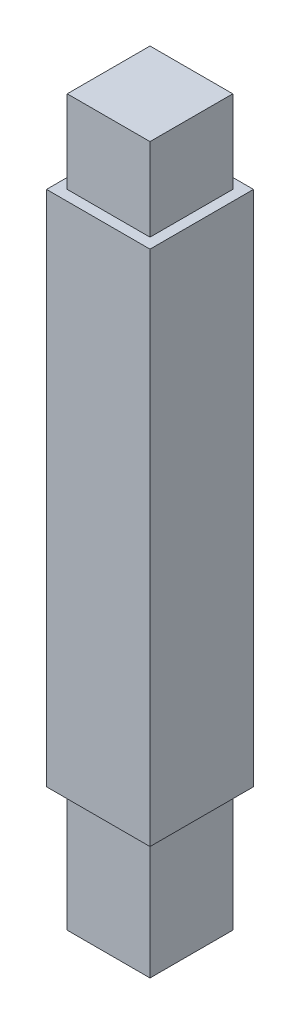
ISO-10303-21;
HEADER;
FILE_DESCRIPTION(('STEP AP214'),'2;1');
FILE_NAME('part.step','',(''),(''),'','','');
FILE_SCHEMA(('AUTOMOTIVE_DESIGN { 1 0 10303 214 1 1 1 1 }'));
ENDSEC;
DATA;
#1=APPLICATION_CONTEXT('core data for automotive mechanical design processes');
#2=APPLICATION_PROTOCOL_DEFINITION('international standard','automotive_design',2000,#1);
#3=PRODUCT_CONTEXT('',#1,'mechanical');
#4=PRODUCT('Part','Part','',(#3));
#5=PRODUCT_RELATED_PRODUCT_CATEGORY('part','',(#4));
#6=PRODUCT_DEFINITION_FORMATION('','',#4);
#7=PRODUCT_DEFINITION_CONTEXT('part definition',#1,'design');
#8=PRODUCT_DEFINITION('design','',#6,#7);
#9=PRODUCT_DEFINITION_SHAPE('','',#8);
#10=(LENGTH_UNIT() NAMED_UNIT(*) SI_UNIT(.MILLI.,.METRE.));
#11=(NAMED_UNIT(*) PLANE_ANGLE_UNIT() SI_UNIT($,.RADIAN.));
#12=(NAMED_UNIT(*) SI_UNIT($,.STERADIAN.) SOLID_ANGLE_UNIT());
#13=UNCERTAINTY_MEASURE_WITH_UNIT(LENGTH_MEASURE(1.E-05),#10,'distance_accuracy_value','');
#14=(GEOMETRIC_REPRESENTATION_CONTEXT(3) GLOBAL_UNCERTAINTY_ASSIGNED_CONTEXT((#13)) GLOBAL_UNIT_ASSIGNED_CONTEXT((#10,
#11,#12)) REPRESENTATION_CONTEXT('',''));
#15=CARTESIAN_POINT('',(0.,0.,0.));
#16=DIRECTION('',(0.,0.,1.));
#17=DIRECTION('',(1.,0.,0.));
#18=AXIS2_PLACEMENT_3D('',#15,#16,#17);
#19=CARTESIAN_POINT('',(0.,0.,12.7));
#20=DIRECTION('',(0.,1.,0.));
#21=DIRECTION('',(0.,0.,1.));
#22=AXIS2_PLACEMENT_3D('',#19,#20,#21);
#23=PLANE('',#22);
#24=DIRECTION('',(1.,0.,0.));
#25=VECTOR('',#24,1.);
#26=CARTESIAN_POINT('',(0.,0.,0.));
#27=LINE('',#26,#25);
#28=CARTESIAN_POINT('',(0.,0.,0.));
#29=VERTEX_POINT('',#28);
#30=CARTESIAN_POINT('',(12.7,0.,0.));
#31=VERTEX_POINT('',#30);
#32=EDGE_CURVE('E202',#29,#31,#27,.T.);
#33=ORIENTED_EDGE('',*,*,#32,.T.);
#34=DIRECTION('',(0.,0.,-1.));
#35=VECTOR('',#34,1.);
#36=CARTESIAN_POINT('',(12.7,0.,12.7));
#37=LINE('',#36,#35);
#38=CARTESIAN_POINT('',(12.7,0.,12.7));
#39=VERTEX_POINT('',#38);
#40=EDGE_CURVE('E49',#39,#31,#37,.T.);
#41=ORIENTED_EDGE('',*,*,#40,.F.);
#42=DIRECTION('',(1.,0.,0.));
#43=VECTOR('',#42,1.);
#44=CARTESIAN_POINT('',(0.,0.,12.7));
#45=LINE('',#44,#43);
#46=CARTESIAN_POINT('',(0.,0.,12.7));
#47=VERTEX_POINT('',#46);
#48=EDGE_CURVE('E192',#47,#39,#45,.T.);
#49=ORIENTED_EDGE('',*,*,#48,.F.);
#50=DIRECTION('',(0.,0.,-1.));
#51=VECTOR('',#50,1.);
#52=CARTESIAN_POINT('',(0.,0.,12.7));
#53=LINE('',#52,#51);
#54=EDGE_CURVE('E11',#47,#29,#53,.T.);
#55=ORIENTED_EDGE('',*,*,#54,.T.);
#56=EDGE_LOOP('',(#33,#41,#49,#55));
#57=FACE_BOUND('',#56,.T.);
#58=DIRECTION('',(0.,0.,-1.));
#59=VECTOR('',#58,1.);
#60=CARTESIAN_POINT('',(1.27,0.,11.43));
#61=LINE('',#60,#59);
#62=CARTESIAN_POINT('',(1.27,0.,11.43));
#63=VERTEX_POINT('',#62);
#64=CARTESIAN_POINT('',(1.27,0.,1.27));
#65=VERTEX_POINT('',#64);
#66=EDGE_CURVE('E56',#63,#65,#61,.T.);
#67=ORIENTED_EDGE('',*,*,#66,.F.);
#68=DIRECTION('',(-1.,0.,0.));
#69=VECTOR('',#68,1.);
#70=CARTESIAN_POINT('',(1.27,0.,11.43));
#71=LINE('',#70,#69);
#72=CARTESIAN_POINT('',(11.43,0.,11.43));
#73=VERTEX_POINT('',#72);
#74=EDGE_CURVE('E60',#73,#63,#71,.T.);
#75=ORIENTED_EDGE('',*,*,#74,.F.);
#76=DIRECTION('',(0.,0.,1.));
#77=VECTOR('',#76,1.);
#78=CARTESIAN_POINT('',(11.43,0.,11.43));
#79=LINE('',#78,#77);
#80=CARTESIAN_POINT('',(11.43,0.,1.27));
#81=VERTEX_POINT('',#80);
#82=EDGE_CURVE('E376',#81,#73,#79,.T.);
#83=ORIENTED_EDGE('',*,*,#82,.F.);
#84=DIRECTION('',(1.,0.,0.));
#85=VECTOR('',#84,1.);
#86=CARTESIAN_POINT('',(1.27,0.,1.27));
#87=LINE('',#86,#85);
#88=EDGE_CURVE('E382',#65,#81,#87,.T.);
#89=ORIENTED_EDGE('',*,*,#88,.F.);
#90=EDGE_LOOP('',(#67,#75,#83,#89));
#91=FACE_BOUND('',#90,.T.);
#92=ADVANCED_FACE('F41',(#57,#91),#23,.F.);
#93=CARTESIAN_POINT('',(0.,63.5,12.7));
#94=DIRECTION('',(0.,-1.,0.));
#95=DIRECTION('',(0.,0.,-1.));
#96=AXIS2_PLACEMENT_3D('',#93,#94,#95);
#97=PLANE('',#96);
#98=DIRECTION('',(-1.,0.,0.));
#99=VECTOR('',#98,1.);
#100=CARTESIAN_POINT('',(0.,63.5,0.));
#101=LINE('',#100,#99);
#102=CARTESIAN_POINT('',(12.7,63.5,0.));
#103=VERTEX_POINT('',#102);
#104=CARTESIAN_POINT('',(0.,63.5,0.));
#105=VERTEX_POINT('',#104);
#106=EDGE_CURVE('E193',#103,#105,#101,.T.);
#107=ORIENTED_EDGE('',*,*,#106,.T.);
#108=DIRECTION('',(0.,0.,-1.));
#109=VECTOR('',#108,1.);
#110=CARTESIAN_POINT('',(0.,63.5,12.7));
#111=LINE('',#110,#109);
#112=CARTESIAN_POINT('',(0.,63.5,12.7));
#113=VERTEX_POINT('',#112);
#114=EDGE_CURVE('E199',#113,#105,#111,.T.);
#115=ORIENTED_EDGE('',*,*,#114,.F.);
#116=DIRECTION('',(-1.,0.,0.));
#117=VECTOR('',#116,1.);
#118=CARTESIAN_POINT('',(0.,63.5,12.7));
#119=LINE('',#118,#117);
#120=CARTESIAN_POINT('',(12.7,63.5,12.7));
#121=VERTEX_POINT('',#120);
#122=EDGE_CURVE('E197',#121,#113,#119,.T.);
#123=ORIENTED_EDGE('',*,*,#122,.F.);
#124=DIRECTION('',(0.,0.,-1.));
#125=VECTOR('',#124,1.);
#126=CARTESIAN_POINT('',(12.7,63.5,12.7));
#127=LINE('',#126,#125);
#128=EDGE_CURVE('E209',#121,#103,#127,.T.);
#129=ORIENTED_EDGE('',*,*,#128,.T.);
#130=EDGE_LOOP('',(#107,#115,#123,#129));
#131=FACE_BOUND('',#130,.T.);
#132=DIRECTION('',(0.,0.,1.));
#133=VECTOR('',#132,1.);
#134=CARTESIAN_POINT('',(1.27,63.5,1.27));
#135=LINE('',#134,#133);
#136=CARTESIAN_POINT('',(1.27,63.5,1.27));
#137=VERTEX_POINT('',#136);
#138=CARTESIAN_POINT('',(1.27,63.5,11.43));
#139=VERTEX_POINT('',#138);
#140=EDGE_CURVE('E150',#137,#139,#135,.T.);
#141=ORIENTED_EDGE('',*,*,#140,.F.);
#142=DIRECTION('',(-1.,0.,0.));
#143=VECTOR('',#142,1.);
#144=CARTESIAN_POINT('',(1.27,63.5,1.27));
#145=LINE('',#144,#143);
#146=CARTESIAN_POINT('',(11.43,63.5,1.27));
#147=VERTEX_POINT('',#146);
#148=EDGE_CURVE('E163',#147,#137,#145,.T.);
#149=ORIENTED_EDGE('',*,*,#148,.F.);
#150=DIRECTION('',(0.,0.,-1.));
#151=VECTOR('',#150,1.);
#152=CARTESIAN_POINT('',(11.43,63.5,1.27));
#153=LINE('',#152,#151);
#154=CARTESIAN_POINT('',(11.43,63.5,11.43));
#155=VERTEX_POINT('',#154);
#156=EDGE_CURVE('E172',#155,#147,#153,.T.);
#157=ORIENTED_EDGE('',*,*,#156,.F.);
#158=DIRECTION('',(1.,0.,0.));
#159=VECTOR('',#158,1.);
#160=CARTESIAN_POINT('',(1.27,63.5,11.43));
#161=LINE('',#160,#159);
#162=EDGE_CURVE('E153',#139,#155,#161,.T.);
#163=ORIENTED_EDGE('',*,*,#162,.F.);
#164=EDGE_LOOP('',(#141,#149,#157,#163));
#165=FACE_BOUND('',#164,.T.);
#166=ADVANCED_FACE('F225',(#131,#165),#97,.F.);
#167=CARTESIAN_POINT('',(0.,0.,12.7));
#168=DIRECTION('',(1.,0.,0.));
#169=DIRECTION('',(0.,0.,-1.));
#170=AXIS2_PLACEMENT_3D('',#167,#168,#169);
#171=PLANE('',#170);
#172=DIRECTION('',(0.,-1.,0.));
#173=VECTOR('',#172,1.);
#174=CARTESIAN_POINT('',(0.,0.,0.));
#175=LINE('',#174,#173);
#176=EDGE_CURVE('E188',#105,#29,#175,.T.);
#177=ORIENTED_EDGE('',*,*,#176,.T.);
#178=ORIENTED_EDGE('',*,*,#54,.F.);
#179=DIRECTION('',(0.,-1.,0.));
#180=VECTOR('',#179,1.);
#181=CARTESIAN_POINT('',(0.,0.,12.7));
#182=LINE('',#181,#180);
#183=EDGE_CURVE('E189',#113,#47,#182,.T.);
#184=ORIENTED_EDGE('',*,*,#183,.F.);
#185=ORIENTED_EDGE('',*,*,#114,.T.);
#186=EDGE_LOOP('',(#177,#178,#184,#185));
#187=FACE_BOUND('',#186,.T.);
#188=ADVANCED_FACE('F43',(#187),#171,.F.);
#189=CARTESIAN_POINT('',(12.7,0.,12.7));
#190=DIRECTION('',(-1.,0.,0.));
#191=DIRECTION('',(0.,0.,1.));
#192=AXIS2_PLACEMENT_3D('',#189,#190,#191);
#193=PLANE('',#192);
#194=DIRECTION('',(0.,1.,0.));
#195=VECTOR('',#194,1.);
#196=CARTESIAN_POINT('',(12.7,0.,0.));
#197=LINE('',#196,#195);
#198=EDGE_CURVE('E204',#31,#103,#197,.T.);
#199=ORIENTED_EDGE('',*,*,#198,.T.);
#200=ORIENTED_EDGE('',*,*,#128,.F.);
#201=DIRECTION('',(0.,1.,0.));
#202=VECTOR('',#201,1.);
#203=CARTESIAN_POINT('',(12.7,0.,12.7));
#204=LINE('',#203,#202);
#205=EDGE_CURVE('E195',#39,#121,#204,.T.);
#206=ORIENTED_EDGE('',*,*,#205,.F.);
#207=ORIENTED_EDGE('',*,*,#40,.T.);
#208=EDGE_LOOP('',(#199,#200,#206,#207));
#209=FACE_BOUND('',#208,.T.);
#210=ADVANCED_FACE('F216',(#209),#193,.F.);
#211=CARTESIAN_POINT('',(0.,0.,12.7));
#212=DIRECTION('',(0.,0.,-1.));
#213=DIRECTION('',(-1.,0.,0.));
#214=AXIS2_PLACEMENT_3D('',#211,#212,#213);
#215=PLANE('',#214);
#216=ORIENTED_EDGE('',*,*,#183,.T.);
#217=ORIENTED_EDGE('',*,*,#48,.T.);
#218=ORIENTED_EDGE('',*,*,#205,.T.);
#219=ORIENTED_EDGE('',*,*,#122,.T.);
#220=EDGE_LOOP('',(#216,#217,#218,#219));
#221=FACE_BOUND('',#220,.T.);
#222=ADVANCED_FACE('F232',(#221),#215,.F.);
#223=CARTESIAN_POINT('',(0.,0.,0.));
#224=DIRECTION('',(0.,0.,-1.));
#225=DIRECTION('',(-1.,0.,0.));
#226=AXIS2_PLACEMENT_3D('',#223,#224,#225);
#227=PLANE('',#226);
#228=ORIENTED_EDGE('',*,*,#176,.F.);
#229=ORIENTED_EDGE('',*,*,#106,.F.);
#230=ORIENTED_EDGE('',*,*,#198,.F.);
#231=ORIENTED_EDGE('',*,*,#32,.F.);
#232=EDGE_LOOP('',(#228,#229,#230,#231));
#233=FACE_BOUND('',#232,.T.);
#234=ADVANCED_FACE('F222',(#233),#227,.T.);
#235=CARTESIAN_POINT('',(1.27,73.66,1.27));
#236=DIRECTION('',(1.,0.,0.));
#237=DIRECTION('',(0.,0.,-1.));
#238=AXIS2_PLACEMENT_3D('',#235,#236,#237);
#239=PLANE('',#238);
#240=ORIENTED_EDGE('',*,*,#140,.T.);
#241=DIRECTION('',(0.,-1.,0.));
#242=VECTOR('',#241,1.);
#243=CARTESIAN_POINT('',(1.27,73.66,11.43));
#244=LINE('',#243,#242);
#245=CARTESIAN_POINT('',(1.27,73.66,11.43));
#246=VERTEX_POINT('',#245);
#247=EDGE_CURVE('E185',#246,#139,#244,.T.);
#248=ORIENTED_EDGE('',*,*,#247,.F.);
#249=DIRECTION('',(0.,0.,1.));
#250=VECTOR('',#249,1.);
#251=CARTESIAN_POINT('',(1.27,73.66,1.27));
#252=LINE('',#251,#250);
#253=CARTESIAN_POINT('',(1.27,73.66,1.27));
#254=VERTEX_POINT('',#253);
#255=EDGE_CURVE('E159',#254,#246,#252,.T.);
#256=ORIENTED_EDGE('',*,*,#255,.F.);
#257=DIRECTION('',(0.,-1.,0.));
#258=VECTOR('',#257,1.);
#259=CARTESIAN_POINT('',(1.27,73.66,1.27));
#260=LINE('',#259,#258);
#261=EDGE_CURVE('E168',#254,#137,#260,.T.);
#262=ORIENTED_EDGE('',*,*,#261,.T.);
#263=EDGE_LOOP('',(#240,#248,#256,#262));
#264=FACE_BOUND('',#263,.T.);
#265=ADVANCED_FACE('F245',(#264),#239,.F.);
#266=CARTESIAN_POINT('',(1.27,73.66,11.43));
#267=DIRECTION('',(0.,0.,-1.));
#268=DIRECTION('',(-1.,0.,0.));
#269=AXIS2_PLACEMENT_3D('',#266,#267,#268);
#270=PLANE('',#269);
#271=ORIENTED_EDGE('',*,*,#162,.T.);
#272=DIRECTION('',(0.,-1.,0.));
#273=VECTOR('',#272,1.);
#274=CARTESIAN_POINT('',(11.43,73.66,11.43));
#275=LINE('',#274,#273);
#276=CARTESIAN_POINT('',(11.43,73.66,11.43));
#277=VERTEX_POINT('',#276);
#278=EDGE_CURVE('E182',#277,#155,#275,.T.);
#279=ORIENTED_EDGE('',*,*,#278,.F.);
#280=DIRECTION('',(1.,0.,0.));
#281=VECTOR('',#280,1.);
#282=CARTESIAN_POINT('',(1.27,73.66,11.43));
#283=LINE('',#282,#281);
#284=EDGE_CURVE('E162',#246,#277,#283,.T.);
#285=ORIENTED_EDGE('',*,*,#284,.F.);
#286=ORIENTED_EDGE('',*,*,#247,.T.);
#287=EDGE_LOOP('',(#271,#279,#285,#286));
#288=FACE_BOUND('',#287,.T.);
#289=ADVANCED_FACE('F250',(#288),#270,.F.);
#290=CARTESIAN_POINT('',(11.43,73.66,1.27));
#291=DIRECTION('',(-1.,0.,0.));
#292=DIRECTION('',(0.,0.,1.));
#293=AXIS2_PLACEMENT_3D('',#290,#291,#292);
#294=PLANE('',#293);
#295=ORIENTED_EDGE('',*,*,#156,.T.);
#296=DIRECTION('',(0.,-1.,0.));
#297=VECTOR('',#296,1.);
#298=CARTESIAN_POINT('',(11.43,73.66,1.27));
#299=LINE('',#298,#297);
#300=CARTESIAN_POINT('',(11.43,73.66,1.27));
#301=VERTEX_POINT('',#300);
#302=EDGE_CURVE('E179',#301,#147,#299,.T.);
#303=ORIENTED_EDGE('',*,*,#302,.F.);
#304=DIRECTION('',(0.,0.,-1.));
#305=VECTOR('',#304,1.);
#306=CARTESIAN_POINT('',(11.43,73.66,1.27));
#307=LINE('',#306,#305);
#308=EDGE_CURVE('E165',#277,#301,#307,.T.);
#309=ORIENTED_EDGE('',*,*,#308,.F.);
#310=ORIENTED_EDGE('',*,*,#278,.T.);
#311=EDGE_LOOP('',(#295,#303,#309,#310));
#312=FACE_BOUND('',#311,.T.);
#313=ADVANCED_FACE('F254',(#312),#294,.F.);
#314=CARTESIAN_POINT('',(1.27,73.66,1.27));
#315=DIRECTION('',(0.,0.,1.));
#316=DIRECTION('',(1.,0.,0.));
#317=AXIS2_PLACEMENT_3D('',#314,#315,#316);
#318=PLANE('',#317);
#319=ORIENTED_EDGE('',*,*,#148,.T.);
#320=ORIENTED_EDGE('',*,*,#261,.F.);
#321=DIRECTION('',(-1.,0.,0.));
#322=VECTOR('',#321,1.);
#323=CARTESIAN_POINT('',(1.27,73.66,1.27));
#324=LINE('',#323,#322);
#325=EDGE_CURVE('E167',#301,#254,#324,.T.);
#326=ORIENTED_EDGE('',*,*,#325,.F.);
#327=ORIENTED_EDGE('',*,*,#302,.T.);
#328=EDGE_LOOP('',(#319,#320,#326,#327));
#329=FACE_BOUND('',#328,.T.);
#330=ADVANCED_FACE('F258',(#329),#318,.F.);
#331=CARTESIAN_POINT('',(0.,73.66,0.));
#332=DIRECTION('',(0.,1.,0.));
#333=DIRECTION('',(0.,0.,1.));
#334=AXIS2_PLACEMENT_3D('',#331,#332,#333);
#335=PLANE('',#334);
#336=ORIENTED_EDGE('',*,*,#255,.T.);
#337=ORIENTED_EDGE('',*,*,#284,.T.);
#338=ORIENTED_EDGE('',*,*,#308,.T.);
#339=ORIENTED_EDGE('',*,*,#325,.T.);
#340=EDGE_LOOP('',(#336,#337,#338,#339));
#341=FACE_BOUND('',#340,.T.);
#342=ADVANCED_FACE('F262',(#341),#335,.T.);
#343=CARTESIAN_POINT('',(1.27,-15.24,11.43));
#344=DIRECTION('',(1.,0.,0.));
#345=DIRECTION('',(0.,0.,-1.));
#346=AXIS2_PLACEMENT_3D('',#343,#344,#345);
#347=PLANE('',#346);
#348=ORIENTED_EDGE('',*,*,#66,.T.);
#349=DIRECTION('',(0.,1.,0.));
#350=VECTOR('',#349,1.);
#351=CARTESIAN_POINT('',(1.27,-15.24,1.27));
#352=LINE('',#351,#350);
#353=CARTESIAN_POINT('',(1.27,-15.24,1.27));
#354=VERTEX_POINT('',#353);
#355=EDGE_CURVE('E133',#354,#65,#352,.T.);
#356=ORIENTED_EDGE('',*,*,#355,.F.);
#357=DIRECTION('',(0.,0.,-1.));
#358=VECTOR('',#357,1.);
#359=CARTESIAN_POINT('',(1.27,-15.24,11.43));
#360=LINE('',#359,#358);
#361=CARTESIAN_POINT('',(1.27,-15.24,11.43));
#362=VERTEX_POINT('',#361);
#363=EDGE_CURVE('E139',#362,#354,#360,.T.);
#364=ORIENTED_EDGE('',*,*,#363,.F.);
#365=DIRECTION('',(0.,1.,0.));
#366=VECTOR('',#365,1.);
#367=CARTESIAN_POINT('',(1.27,-15.24,11.43));
#368=LINE('',#367,#366);
#369=EDGE_CURVE('E374',#362,#63,#368,.T.);
#370=ORIENTED_EDGE('',*,*,#369,.T.);
#371=EDGE_LOOP('',(#348,#356,#364,#370));
#372=FACE_BOUND('',#371,.T.);
#373=ADVANCED_FACE('F149',(#372),#347,.F.);
#374=CARTESIAN_POINT('',(1.27,-15.24,1.27));
#375=DIRECTION('',(0.,0.,1.));
#376=DIRECTION('',(1.,0.,0.));
#377=AXIS2_PLACEMENT_3D('',#374,#375,#376);
#378=PLANE('',#377);
#379=ORIENTED_EDGE('',*,*,#88,.T.);
#380=DIRECTION('',(0.,1.,0.));
#381=VECTOR('',#380,1.);
#382=CARTESIAN_POINT('',(11.43,-15.24,1.27));
#383=LINE('',#382,#381);
#384=CARTESIAN_POINT('',(11.43,-15.24,1.27));
#385=VERTEX_POINT('',#384);
#386=EDGE_CURVE('E135',#385,#81,#383,.T.);
#387=ORIENTED_EDGE('',*,*,#386,.F.);
#388=DIRECTION('',(1.,0.,0.));
#389=VECTOR('',#388,1.);
#390=CARTESIAN_POINT('',(1.27,-15.24,1.27));
#391=LINE('',#390,#389);
#392=EDGE_CURVE('E128',#354,#385,#391,.T.);
#393=ORIENTED_EDGE('',*,*,#392,.F.);
#394=ORIENTED_EDGE('',*,*,#355,.T.);
#395=EDGE_LOOP('',(#379,#387,#393,#394));
#396=FACE_BOUND('',#395,.T.);
#397=ADVANCED_FACE('F131',(#396),#378,.F.);
#398=CARTESIAN_POINT('',(11.43,-15.24,11.43));
#399=DIRECTION('',(-1.,0.,0.));
#400=DIRECTION('',(0.,0.,1.));
#401=AXIS2_PLACEMENT_3D('',#398,#399,#400);
#402=PLANE('',#401);
#403=ORIENTED_EDGE('',*,*,#82,.T.);
#404=DIRECTION('',(0.,1.,0.));
#405=VECTOR('',#404,1.);
#406=CARTESIAN_POINT('',(11.43,-15.24,11.43));
#407=LINE('',#406,#405);
#408=CARTESIAN_POINT('',(11.43,-15.24,11.43));
#409=VERTEX_POINT('',#408);
#410=EDGE_CURVE('E155',#409,#73,#407,.T.);
#411=ORIENTED_EDGE('',*,*,#410,.F.);
#412=DIRECTION('',(0.,0.,1.));
#413=VECTOR('',#412,1.);
#414=CARTESIAN_POINT('',(11.43,-15.24,11.43));
#415=LINE('',#414,#413);
#416=EDGE_CURVE('E138',#385,#409,#415,.T.);
#417=ORIENTED_EDGE('',*,*,#416,.F.);
#418=ORIENTED_EDGE('',*,*,#386,.T.);
#419=EDGE_LOOP('',(#403,#411,#417,#418));
#420=FACE_BOUND('',#419,.T.);
#421=ADVANCED_FACE('F269',(#420),#402,.F.);
#422=CARTESIAN_POINT('',(1.27,-15.24,11.43));
#423=DIRECTION('',(0.,0.,-1.));
#424=DIRECTION('',(-1.,0.,0.));
#425=AXIS2_PLACEMENT_3D('',#422,#423,#424);
#426=PLANE('',#425);
#427=ORIENTED_EDGE('',*,*,#74,.T.);
#428=ORIENTED_EDGE('',*,*,#369,.F.);
#429=DIRECTION('',(-1.,0.,0.));
#430=VECTOR('',#429,1.);
#431=CARTESIAN_POINT('',(1.27,-15.24,11.43));
#432=LINE('',#431,#430);
#433=EDGE_CURVE('E144',#409,#362,#432,.T.);
#434=ORIENTED_EDGE('',*,*,#433,.F.);
#435=ORIENTED_EDGE('',*,*,#410,.T.);
#436=EDGE_LOOP('',(#427,#428,#434,#435));
#437=FACE_BOUND('',#436,.T.);
#438=ADVANCED_FACE('F272',(#437),#426,.F.);
#439=CARTESIAN_POINT('',(0.,-15.24,0.));
#440=DIRECTION('',(0.,-1.,0.));
#441=DIRECTION('',(0.,0.,-1.));
#442=AXIS2_PLACEMENT_3D('',#439,#440,#441);
#443=PLANE('',#442);
#444=ORIENTED_EDGE('',*,*,#363,.T.);
#445=ORIENTED_EDGE('',*,*,#392,.T.);
#446=ORIENTED_EDGE('',*,*,#416,.T.);
#447=ORIENTED_EDGE('',*,*,#433,.T.);
#448=EDGE_LOOP('',(#444,#445,#446,#447));
#449=FACE_BOUND('',#448,.T.);
#450=ADVANCED_FACE('F142',(#449),#443,.T.);
#451=CLOSED_SHELL('',(#92,#166,#188,#210,#222,#234,#265,#289,#313,#330,#342,#373,#397,#421,#438,#450));
#452=MANIFOLD_SOLID_BREP('B2',#451);
#453=ADVANCED_BREP_SHAPE_REPRESENTATION('',(#18,#452),#14);
#454=SHAPE_DEFINITION_REPRESENTATION(#9,#453);
ENDSEC;
END-ISO-10303-21;
